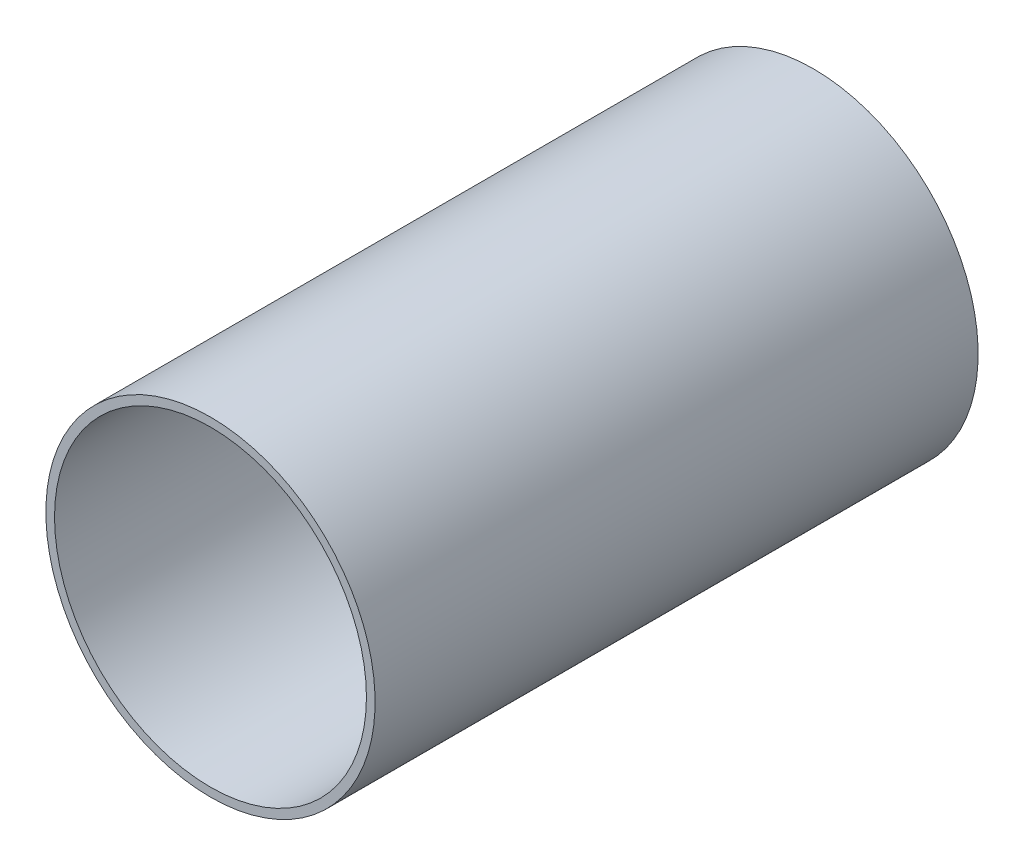
ISO-10303-21;
HEADER;
FILE_DESCRIPTION(('STEP AP214'),'2;1');
FILE_NAME('part.step','',(''),(''),'','','');
FILE_SCHEMA(('AUTOMOTIVE_DESIGN { 1 0 10303 214 1 1 1 1 }'));
ENDSEC;
DATA;
#1=APPLICATION_CONTEXT('core data for automotive mechanical design processes');
#2=APPLICATION_PROTOCOL_DEFINITION('international standard','automotive_design',2000,#1);
#3=PRODUCT_CONTEXT('',#1,'mechanical');
#4=PRODUCT('Part','Part','',(#3));
#5=PRODUCT_RELATED_PRODUCT_CATEGORY('part','',(#4));
#6=PRODUCT_DEFINITION_FORMATION('','',#4);
#7=PRODUCT_DEFINITION_CONTEXT('part definition',#1,'design');
#8=PRODUCT_DEFINITION('design','',#6,#7);
#9=PRODUCT_DEFINITION_SHAPE('','',#8);
#10=(LENGTH_UNIT() NAMED_UNIT(*) SI_UNIT(.MILLI.,.METRE.));
#11=(NAMED_UNIT(*) PLANE_ANGLE_UNIT() SI_UNIT($,.RADIAN.));
#12=(NAMED_UNIT(*) SI_UNIT($,.STERADIAN.) SOLID_ANGLE_UNIT());
#13=UNCERTAINTY_MEASURE_WITH_UNIT(LENGTH_MEASURE(1.E-05),#10,'distance_accuracy_value','');
#14=(GEOMETRIC_REPRESENTATION_CONTEXT(3) GLOBAL_UNCERTAINTY_ASSIGNED_CONTEXT((#13)) GLOBAL_UNIT_ASSIGNED_CONTEXT((#10,
#11,#12)) REPRESENTATION_CONTEXT('',''));
#15=CARTESIAN_POINT('',(0.,0.,0.));
#16=DIRECTION('',(0.,0.,1.));
#17=DIRECTION('',(1.,0.,0.));
#18=AXIS2_PLACEMENT_3D('',#15,#16,#17);
#19=CARTESIAN_POINT('',(177.26,-126.956,-0.045));
#20=DIRECTION('',(0.,0.,-1.));
#21=DIRECTION('',(0.,-1.,0.));
#22=AXIS2_PLACEMENT_3D('',#19,#20,#21);
#23=CYLINDRICAL_SURFACE('',#22,0.45);
#24=CARTESIAN_POINT('',(177.26,-126.956,-0.035));
#25=DIRECTION('',(0.,0.,-1.));
#26=DIRECTION('',(0.,-1.,0.));
#27=AXIS2_PLACEMENT_3D('',#24,#25,#26);
#28=CIRCLE('',#27,0.45);
#29=CARTESIAN_POINT('',(177.26,-127.406,-0.035));
#30=VERTEX_POINT('',#29);
#31=EDGE_CURVE('E64',#30,#30,#28,.T.);
#32=ORIENTED_EDGE('',*,*,#31,.T.);
#33=DIRECTION('',(0.,0.,1.));
#34=VECTOR('',#33,1.);
#35=CARTESIAN_POINT('',(177.26,-127.406,-0.045));
#36=LINE('',#35,#34);
#37=CARTESIAN_POINT('',(177.26,-127.406,1.705));
#38=VERTEX_POINT('',#37);
#39=EDGE_CURVE('E11',#30,#38,#36,.T.);
#40=ORIENTED_EDGE('',*,*,#39,.T.);
#41=CARTESIAN_POINT('',(177.26,-126.956,1.705));
#42=DIRECTION('',(0.,0.,-1.));
#43=DIRECTION('',(0.,-1.,0.));
#44=AXIS2_PLACEMENT_3D('',#41,#42,#43);
#45=CIRCLE('',#44,0.45);
#46=EDGE_CURVE('E25',#38,#38,#45,.T.);
#47=ORIENTED_EDGE('',*,*,#46,.F.);
#48=ORIENTED_EDGE('',*,*,#39,.F.);
#49=EDGE_LOOP('',(#32,#40,#47,#48));
#50=FACE_BOUND('',#49,.T.);
#51=ADVANCED_FACE('F17',(#50),#23,.F.);
#52=CARTESIAN_POINT('',(177.26,-127.431,1.705));
#53=DIRECTION('',(0.,0.,1.));
#54=DIRECTION('',(1.,0.,0.));
#55=AXIS2_PLACEMENT_3D('',#52,#53,#54);
#56=PLANE('',#55);
#57=ORIENTED_EDGE('',*,*,#46,.T.);
#58=EDGE_LOOP('',(#57));
#59=FACE_BOUND('',#58,.T.);
#60=CARTESIAN_POINT('',(177.26,-126.956,1.705));
#61=DIRECTION('',(0.,0.,1.));
#62=DIRECTION('',(0.,-1.,0.));
#63=AXIS2_PLACEMENT_3D('',#60,#61,#62);
#64=CIRCLE('',#63,0.475);
#65=CARTESIAN_POINT('',(177.26,-127.431,1.705));
#66=VERTEX_POINT('',#65);
#67=EDGE_CURVE('E56',#66,#66,#64,.T.);
#68=ORIENTED_EDGE('',*,*,#67,.T.);
#69=EDGE_LOOP('',(#68));
#70=FACE_BOUND('',#69,.T.);
#71=ADVANCED_FACE('F73',(#59,#70),#56,.T.);
#72=CARTESIAN_POINT('',(177.26,-127.431,-0.035));
#73=DIRECTION('',(0.,0.,1.));
#74=DIRECTION('',(1.,0.,0.));
#75=AXIS2_PLACEMENT_3D('',#72,#73,#74);
#76=PLANE('',#75);
#77=ORIENTED_EDGE('',*,*,#31,.F.);
#78=EDGE_LOOP('',(#77));
#79=FACE_BOUND('',#78,.T.);
#80=CARTESIAN_POINT('',(177.26,-126.956,-0.035));
#81=DIRECTION('',(0.,0.,1.));
#82=DIRECTION('',(0.,-1.,0.));
#83=AXIS2_PLACEMENT_3D('',#80,#81,#82);
#84=CIRCLE('',#83,0.475);
#85=CARTESIAN_POINT('',(177.26,-127.431,-0.035));
#86=VERTEX_POINT('',#85);
#87=EDGE_CURVE('E55',#86,#86,#84,.T.);
#88=ORIENTED_EDGE('',*,*,#87,.F.);
#89=EDGE_LOOP('',(#88));
#90=FACE_BOUND('',#89,.T.);
#91=ADVANCED_FACE('F82',(#79,#90),#76,.F.);
#92=CARTESIAN_POINT('',(177.26,-126.956,-0.035));
#93=DIRECTION('',(0.,0.,-1.));
#94=DIRECTION('',(0.,-1.,0.));
#95=AXIS2_PLACEMENT_3D('',#92,#93,#94);
#96=CYLINDRICAL_SURFACE('',#95,0.475);
#97=ORIENTED_EDGE('',*,*,#87,.T.);
#98=DIRECTION('',(0.,0.,1.));
#99=VECTOR('',#98,1.);
#100=CARTESIAN_POINT('',(177.26,-127.431,-0.035));
#101=LINE('',#100,#99);
#102=EDGE_CURVE('E52',#86,#66,#101,.T.);
#103=ORIENTED_EDGE('',*,*,#102,.T.);
#104=ORIENTED_EDGE('',*,*,#67,.F.);
#105=ORIENTED_EDGE('',*,*,#102,.F.);
#106=EDGE_LOOP('',(#97,#103,#104,#105));
#107=FACE_BOUND('',#106,.T.);
#108=ADVANCED_FACE('F53',(#107),#96,.T.);
#109=CLOSED_SHELL('',(#51,#71,#91,#108));
#110=MANIFOLD_SOLID_BREP('B1',#109);
#111=ADVANCED_BREP_SHAPE_REPRESENTATION('',(#18,#110),#14);
#112=SHAPE_DEFINITION_REPRESENTATION(#9,#111);
ENDSEC;
END-ISO-10303-21;
